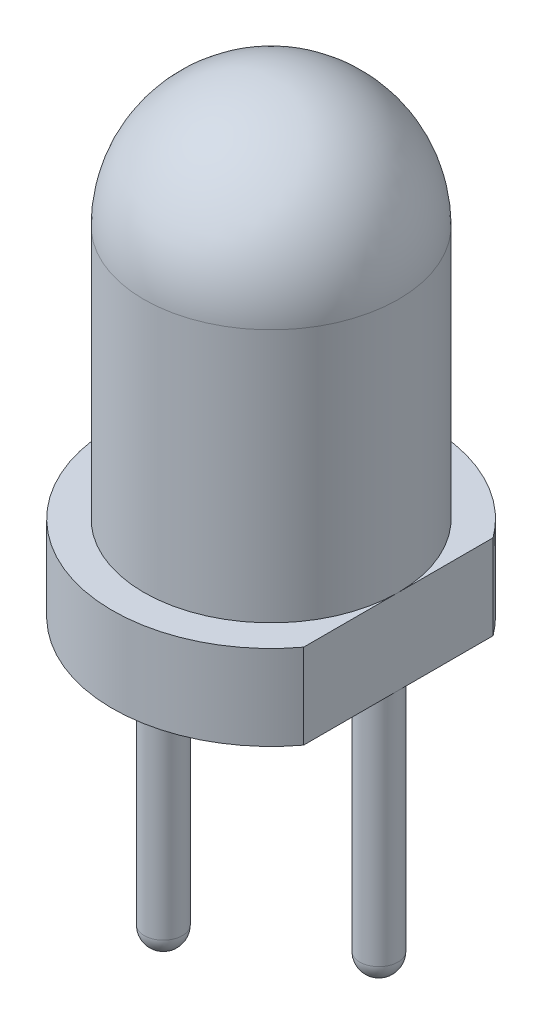
ISO-10303-21;
HEADER;
FILE_DESCRIPTION(('STEP AP214'),'2;1');
FILE_NAME('part.step','',(''),(''),'','','');
FILE_SCHEMA(('AUTOMOTIVE_DESIGN { 1 0 10303 214 1 1 1 1 }'));
ENDSEC;
DATA;
#1=APPLICATION_CONTEXT('core data for automotive mechanical design processes');
#2=APPLICATION_PROTOCOL_DEFINITION('international standard','automotive_design',2000,#1);
#3=PRODUCT_CONTEXT('',#1,'mechanical');
#4=PRODUCT('Part','Part','',(#3));
#5=PRODUCT_RELATED_PRODUCT_CATEGORY('part','',(#4));
#6=PRODUCT_DEFINITION_FORMATION('','',#4);
#7=PRODUCT_DEFINITION_CONTEXT('part definition',#1,'design');
#8=PRODUCT_DEFINITION('design','',#6,#7);
#9=PRODUCT_DEFINITION_SHAPE('','',#8);
#10=(LENGTH_UNIT() NAMED_UNIT(*) SI_UNIT(.MILLI.,.METRE.));
#11=(NAMED_UNIT(*) PLANE_ANGLE_UNIT() SI_UNIT($,.RADIAN.));
#12=(NAMED_UNIT(*) SI_UNIT($,.STERADIAN.) SOLID_ANGLE_UNIT());
#13=UNCERTAINTY_MEASURE_WITH_UNIT(LENGTH_MEASURE(1.E-05),#10,'distance_accuracy_value','');
#14=(GEOMETRIC_REPRESENTATION_CONTEXT(3) GLOBAL_UNCERTAINTY_ASSIGNED_CONTEXT((#13)) GLOBAL_UNIT_ASSIGNED_CONTEXT((#10,
#11,#12)) REPRESENTATION_CONTEXT('',''));
#15=CARTESIAN_POINT('',(0.,0.,0.));
#16=DIRECTION('',(0.,0.,1.));
#17=DIRECTION('',(1.,0.,0.));
#18=AXIS2_PLACEMENT_3D('',#15,#16,#17);
#19=CARTESIAN_POINT('',(1.27,-4.,0.));
#20=DIRECTION('',(0.,1.,0.));
#21=DIRECTION('',(0.,0.,1.));
#22=AXIS2_PLACEMENT_3D('',#19,#20,#21);
#23=CYLINDRICAL_SURFACE('',#22,0.225);
#24=CARTESIAN_POINT('',(1.27,-2.775,0.));
#25=DIRECTION('',(0.,1.,0.));
#26=DIRECTION('',(0.,0.,1.));
#27=AXIS2_PLACEMENT_3D('',#24,#25,#26);
#28=CIRCLE('',#27,0.225);
#29=CARTESIAN_POINT('',(1.27,-2.775,0.225));
#30=VERTEX_POINT('',#29);
#31=EDGE_CURVE('E46',#30,#30,#28,.T.);
#32=ORIENTED_EDGE('',*,*,#31,.T.);
#33=EDGE_LOOP('',(#32));
#34=FACE_BOUND('',#33,.T.);
#35=CARTESIAN_POINT('',(1.27,0.,0.));
#36=DIRECTION('',(0.,1.,0.));
#37=DIRECTION('',(0.,0.,1.));
#38=AXIS2_PLACEMENT_3D('',#35,#36,#37);
#39=CIRCLE('',#38,0.225);
#40=CARTESIAN_POINT('',(1.27,0.,0.225));
#41=VERTEX_POINT('',#40);
#42=EDGE_CURVE('E86',#41,#41,#39,.F.);
#43=ORIENTED_EDGE('',*,*,#42,.T.);
#44=EDGE_LOOP('',(#43));
#45=FACE_BOUND('',#44,.T.);
#46=ADVANCED_FACE('F38',(#34,#45),#23,.T.);
#47=CARTESIAN_POINT('',(0.,0.,0.));
#48=DIRECTION('',(0.,1.,0.));
#49=DIRECTION('',(0.,0.,1.));
#50=AXIS2_PLACEMENT_3D('',#47,#48,#49);
#51=PLANE('',#50);
#52=CARTESIAN_POINT('',(-1.27,0.,0.));
#53=DIRECTION('',(0.,1.,0.));
#54=DIRECTION('',(0.,0.,1.));
#55=AXIS2_PLACEMENT_3D('',#52,#53,#54);
#56=CIRCLE('',#55,0.225);
#57=CARTESIAN_POINT('',(-1.27,0.,0.225));
#58=VERTEX_POINT('',#57);
#59=EDGE_CURVE('E94',#58,#58,#56,.F.);
#60=ORIENTED_EDGE('',*,*,#59,.F.);
#61=EDGE_LOOP('',(#60));
#62=FACE_BOUND('',#61,.T.);
#63=ORIENTED_EDGE('',*,*,#42,.F.);
#64=EDGE_LOOP('',(#63));
#65=FACE_BOUND('',#64,.T.);
#66=CARTESIAN_POINT('',(0.,0.,0.));
#67=DIRECTION('',(0.,-1.,0.));
#68=DIRECTION('',(0.,0.,-1.));
#69=AXIS2_PLACEMENT_3D('',#66,#67,#68);
#70=CIRCLE('',#69,1.87);
#71=CARTESIAN_POINT('',(1.5,0.,1.11664676599182));
#72=VERTEX_POINT('',#71);
#73=CARTESIAN_POINT('',(1.5,0.,-1.11664676599182));
#74=VERTEX_POINT('',#73);
#75=EDGE_CURVE('E80',#72,#74,#70,.T.);
#76=ORIENTED_EDGE('',*,*,#75,.T.);
#77=DIRECTION('',(0.,0.,-1.));
#78=VECTOR('',#77,1.);
#79=CARTESIAN_POINT('',(1.5,0.,0.));
#80=LINE('',#79,#78);
#81=EDGE_CURVE('E81',#72,#74,#80,.T.);
#82=ORIENTED_EDGE('',*,*,#81,.F.);
#83=EDGE_LOOP('',(#76,#82));
#84=FACE_BOUND('',#83,.T.);
#85=ADVANCED_FACE('F113',(#62,#65,#84),#51,.F.);
#86=CARTESIAN_POINT('',(0.,0.,0.));
#87=DIRECTION('',(0.,-1.,0.));
#88=DIRECTION('',(0.,0.,-1.));
#89=AXIS2_PLACEMENT_3D('',#86,#87,#88);
#90=CYLINDRICAL_SURFACE('',#89,1.87);
#91=CARTESIAN_POINT('',(0.,1.,0.));
#92=DIRECTION('',(0.,-1.,0.));
#93=DIRECTION('',(0.,0.,-1.));
#94=AXIS2_PLACEMENT_3D('',#91,#92,#93);
#95=CIRCLE('',#94,1.87);
#96=CARTESIAN_POINT('',(1.5,1.,1.11664676599182));
#97=VERTEX_POINT('',#96);
#98=CARTESIAN_POINT('',(1.5,1.,-1.11664676599182));
#99=VERTEX_POINT('',#98);
#100=EDGE_CURVE('E78',#97,#99,#95,.T.);
#101=ORIENTED_EDGE('',*,*,#100,.T.);
#102=DIRECTION('',(0.,-1.,0.));
#103=VECTOR('',#102,1.);
#104=CARTESIAN_POINT('',(1.5,5.491,-1.11664676599182));
#105=LINE('',#104,#103);
#106=EDGE_CURVE('E53',#99,#74,#105,.T.);
#107=ORIENTED_EDGE('',*,*,#106,.T.);
#108=ORIENTED_EDGE('',*,*,#75,.F.);
#109=DIRECTION('',(0.,-1.,0.));
#110=VECTOR('',#109,1.);
#111=CARTESIAN_POINT('',(1.5,5.491,1.11664676599182));
#112=LINE('',#111,#110);
#113=EDGE_CURVE('E68',#97,#72,#112,.T.);
#114=ORIENTED_EDGE('',*,*,#113,.F.);
#115=EDGE_LOOP('',(#101,#107,#108,#114));
#116=FACE_BOUND('',#115,.T.);
#117=ADVANCED_FACE('F77',(#116),#90,.T.);
#118=CARTESIAN_POINT('',(-1.87,1.,0.));
#119=DIRECTION('',(0.,-1.,0.));
#120=DIRECTION('',(0.,0.,-1.));
#121=AXIS2_PLACEMENT_3D('',#118,#119,#120);
#122=PLANE('',#121);
#123=ORIENTED_EDGE('',*,*,#100,.F.);
#124=DIRECTION('',(0.,0.,1.));
#125=VECTOR('',#124,1.);
#126=CARTESIAN_POINT('',(1.5,1.,0.));
#127=LINE('',#126,#125);
#128=CARTESIAN_POINT('',(1.5,1.,0.));
#129=VERTEX_POINT('',#128);
#130=EDGE_CURVE('E65',#129,#97,#127,.T.);
#131=ORIENTED_EDGE('',*,*,#130,.F.);
#132=CARTESIAN_POINT('',(0.,1.,0.));
#133=DIRECTION('',(0.,-1.,0.));
#134=DIRECTION('',(0.,0.,-1.));
#135=AXIS2_PLACEMENT_3D('',#132,#133,#134);
#136=CIRCLE('',#135,1.5);
#137=EDGE_CURVE('E84',#129,#129,#136,.T.);
#138=ORIENTED_EDGE('',*,*,#137,.T.);
#139=EDGE_CURVE('E57',#99,#129,#127,.T.);
#140=ORIENTED_EDGE('',*,*,#139,.F.);
#141=EDGE_LOOP('',(#123,#131,#138,#140));
#142=FACE_BOUND('',#141,.T.);
#143=ADVANCED_FACE('F83',(#142),#122,.F.);
#144=CARTESIAN_POINT('',(0.,0.,0.));
#145=DIRECTION('',(0.,-1.,0.));
#146=DIRECTION('',(0.,0.,-1.));
#147=AXIS2_PLACEMENT_3D('',#144,#145,#146);
#148=CYLINDRICAL_SURFACE('',#147,1.5);
#149=ORIENTED_EDGE('',*,*,#137,.F.);
#150=EDGE_LOOP('',(#149));
#151=FACE_BOUND('',#150,.T.);
#152=CARTESIAN_POINT('',(0.,3.99,0.));
#153=DIRECTION('',(0.,-1.,0.));
#154=DIRECTION('',(0.,0.,-1.));
#155=AXIS2_PLACEMENT_3D('',#152,#153,#154);
#156=CIRCLE('',#155,1.5);
#157=CARTESIAN_POINT('',(0.,3.99,-1.5));
#158=VERTEX_POINT('',#157);
#159=EDGE_CURVE('E88',#158,#158,#156,.T.);
#160=ORIENTED_EDGE('',*,*,#159,.T.);
#161=EDGE_LOOP('',(#160));
#162=FACE_BOUND('',#161,.T.);
#163=ADVANCED_FACE('F125',(#151,#162),#148,.T.);
#164=CARTESIAN_POINT('',(0.,3.99,0.));
#165=DIRECTION('',(0.,-1.,0.));
#166=DIRECTION('',(-1.,0.,0.));
#167=AXIS2_PLACEMENT_3D('',#164,#165,#166);
#168=SPHERICAL_SURFACE('',#167,1.5);
#169=ORIENTED_EDGE('',*,*,#159,.F.);
#170=EDGE_LOOP('',(#169));
#171=FACE_BOUND('',#170,.T.);
#172=ADVANCED_FACE('F122',(#171),#168,.T.);
#173=CARTESIAN_POINT('',(1.5,5.491,0.));
#174=DIRECTION('',(-1.,0.,0.));
#175=DIRECTION('',(0.,0.,1.));
#176=AXIS2_PLACEMENT_3D('',#173,#174,#175);
#177=PLANE('',#176);
#178=ORIENTED_EDGE('',*,*,#139,.T.);
#179=ORIENTED_EDGE('',*,*,#130,.T.);
#180=ORIENTED_EDGE('',*,*,#113,.T.);
#181=ORIENTED_EDGE('',*,*,#81,.T.);
#182=ORIENTED_EDGE('',*,*,#106,.F.);
#183=EDGE_LOOP('',(#178,#179,#180,#181,#182));
#184=FACE_BOUND('',#183,.T.);
#185=ADVANCED_FACE('F67',(#184),#177,.F.);
#186=CARTESIAN_POINT('',(-1.27,-4.,0.));
#187=DIRECTION('',(0.,1.,0.));
#188=DIRECTION('',(0.,0.,1.));
#189=AXIS2_PLACEMENT_3D('',#186,#187,#188);
#190=CYLINDRICAL_SURFACE('',#189,0.225);
#191=CARTESIAN_POINT('',(-1.27,-3.775,0.));
#192=DIRECTION('',(0.,1.,0.));
#193=DIRECTION('',(0.,0.,1.));
#194=AXIS2_PLACEMENT_3D('',#191,#192,#193);
#195=CIRCLE('',#194,0.225);
#196=CARTESIAN_POINT('',(-1.27,-3.775,0.225));
#197=VERTEX_POINT('',#196);
#198=EDGE_CURVE('E11',#197,#197,#195,.T.);
#199=ORIENTED_EDGE('',*,*,#198,.T.);
#200=EDGE_LOOP('',(#199));
#201=FACE_BOUND('',#200,.T.);
#202=ORIENTED_EDGE('',*,*,#59,.T.);
#203=EDGE_LOOP('',(#202));
#204=FACE_BOUND('',#203,.T.);
#205=ADVANCED_FACE('F103',(#201,#204),#190,.T.);
#206=CARTESIAN_POINT('',(1.27,-2.775,0.));
#207=DIRECTION('',(0.,-1.,0.));
#208=DIRECTION('',(0.,0.,-1.));
#209=AXIS2_PLACEMENT_3D('',#206,#207,#208);
#210=SPHERICAL_SURFACE('',#209,0.225);
#211=ORIENTED_EDGE('',*,*,#31,.F.);
#212=EDGE_LOOP('',(#211));
#213=FACE_BOUND('',#212,.T.);
#214=ADVANCED_FACE('F101',(#213),#210,.T.);
#215=CARTESIAN_POINT('',(-1.27,-3.775,0.));
#216=DIRECTION('',(0.,-1.,0.));
#217=DIRECTION('',(0.,0.,-1.));
#218=AXIS2_PLACEMENT_3D('',#215,#216,#217);
#219=SPHERICAL_SURFACE('',#218,0.225);
#220=ORIENTED_EDGE('',*,*,#198,.F.);
#221=EDGE_LOOP('',(#220));
#222=FACE_BOUND('',#221,.T.);
#223=ADVANCED_FACE('F40',(#222),#219,.T.);
#224=CLOSED_SHELL('',(#46,#85,#117,#143,#163,#172,#185,#205,#214,#223));
#225=MANIFOLD_SOLID_BREP('B2',#224);
#226=ADVANCED_BREP_SHAPE_REPRESENTATION('',(#18,#225),#14);
#227=SHAPE_DEFINITION_REPRESENTATION(#9,#226);
ENDSEC;
END-ISO-10303-21;
